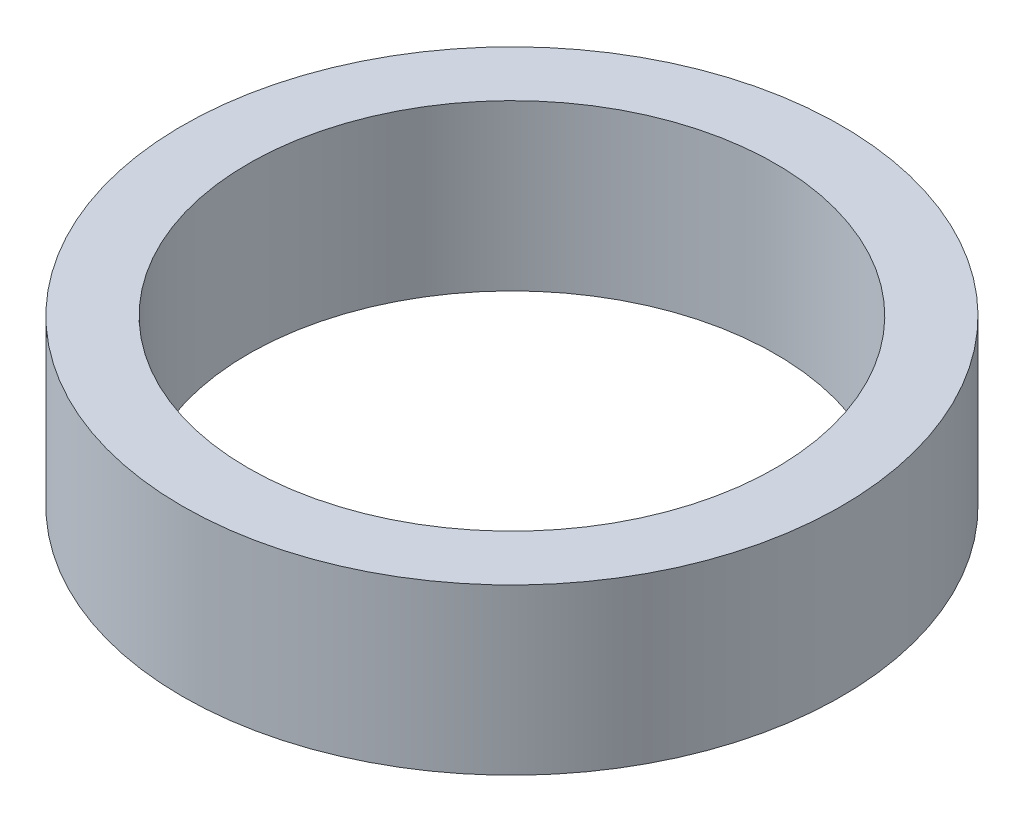
ISO-10303-21;
HEADER;
FILE_DESCRIPTION(('STEP AP214'),'2;1');
FILE_NAME('part.step','',(''),(''),'','','');
FILE_SCHEMA(('AUTOMOTIVE_DESIGN { 1 0 10303 214 1 1 1 1 }'));
ENDSEC;
DATA;
#1=APPLICATION_CONTEXT('core data for automotive mechanical design processes');
#2=APPLICATION_PROTOCOL_DEFINITION('international standard','automotive_design',2000,#1);
#3=PRODUCT_CONTEXT('',#1,'mechanical');
#4=PRODUCT('Part','Part','',(#3));
#5=PRODUCT_RELATED_PRODUCT_CATEGORY('part','',(#4));
#6=PRODUCT_DEFINITION_FORMATION('','',#4);
#7=PRODUCT_DEFINITION_CONTEXT('part definition',#1,'design');
#8=PRODUCT_DEFINITION('design','',#6,#7);
#9=PRODUCT_DEFINITION_SHAPE('','',#8);
#10=(LENGTH_UNIT() NAMED_UNIT(*) SI_UNIT(.MILLI.,.METRE.));
#11=(NAMED_UNIT(*) PLANE_ANGLE_UNIT() SI_UNIT($,.RADIAN.));
#12=(NAMED_UNIT(*) SI_UNIT($,.STERADIAN.) SOLID_ANGLE_UNIT());
#13=UNCERTAINTY_MEASURE_WITH_UNIT(LENGTH_MEASURE(1.E-05),#10,'distance_accuracy_value','');
#14=(GEOMETRIC_REPRESENTATION_CONTEXT(3) GLOBAL_UNCERTAINTY_ASSIGNED_CONTEXT((#13)) GLOBAL_UNIT_ASSIGNED_CONTEXT((#10,
#11,#12)) REPRESENTATION_CONTEXT('',''));
#15=CARTESIAN_POINT('',(0.,0.,0.));
#16=DIRECTION('',(0.,0.,1.));
#17=DIRECTION('',(1.,0.,0.));
#18=AXIS2_PLACEMENT_3D('',#15,#16,#17);
#19=CARTESIAN_POINT('',(0.,25.,0.));
#20=DIRECTION('',(0.,-1.,0.));
#21=DIRECTION('',(0.,0.,-1.));
#22=AXIS2_PLACEMENT_3D('',#19,#20,#21);
#23=CYLINDRICAL_SURFACE('',#22,50.);
#24=CARTESIAN_POINT('',(0.,25.,0.));
#25=DIRECTION('',(0.,1.,0.));
#26=DIRECTION('',(0.,0.,1.));
#27=AXIS2_PLACEMENT_3D('',#24,#25,#26);
#28=CIRCLE('',#27,50.);
#29=CARTESIAN_POINT('',(0.,25.,50.));
#30=VERTEX_POINT('',#29);
#31=EDGE_CURVE('E10',#30,#30,#28,.T.);
#32=ORIENTED_EDGE('',*,*,#31,.F.);
#33=EDGE_LOOP('',(#32));
#34=FACE_BOUND('',#33,.T.);
#35=CARTESIAN_POINT('',(0.,0.,0.));
#36=DIRECTION('',(0.,1.,0.));
#37=DIRECTION('',(0.,0.,1.));
#38=AXIS2_PLACEMENT_3D('',#35,#36,#37);
#39=CIRCLE('',#38,50.);
#40=CARTESIAN_POINT('',(0.,0.,50.));
#41=VERTEX_POINT('',#40);
#42=EDGE_CURVE('E37',#41,#41,#39,.T.);
#43=ORIENTED_EDGE('',*,*,#42,.T.);
#44=EDGE_LOOP('',(#43));
#45=FACE_BOUND('',#44,.T.);
#46=ADVANCED_FACE('F40',(#34,#45),#23,.T.);
#47=CARTESIAN_POINT('',(0.,25.,0.));
#48=DIRECTION('',(0.,1.,0.));
#49=DIRECTION('',(0.,0.,1.));
#50=AXIS2_PLACEMENT_3D('',#47,#48,#49);
#51=PLANE('',#50);
#52=CARTESIAN_POINT('',(0.,25.,0.));
#53=DIRECTION('',(0.,1.,0.));
#54=DIRECTION('',(0.,0.,1.));
#55=AXIS2_PLACEMENT_3D('',#52,#53,#54);
#56=CIRCLE('',#55,40.);
#57=CARTESIAN_POINT('',(0.,25.,40.));
#58=VERTEX_POINT('',#57);
#59=EDGE_CURVE('E50',#58,#58,#56,.T.);
#60=ORIENTED_EDGE('',*,*,#59,.F.);
#61=EDGE_LOOP('',(#60));
#62=FACE_BOUND('',#61,.T.);
#63=ORIENTED_EDGE('',*,*,#31,.T.);
#64=EDGE_LOOP('',(#63));
#65=FACE_BOUND('',#64,.T.);
#66=ADVANCED_FACE('F59',(#62,#65),#51,.T.);
#67=CARTESIAN_POINT('',(0.,0.,0.));
#68=DIRECTION('',(0.,1.,0.));
#69=DIRECTION('',(0.,0.,1.));
#70=AXIS2_PLACEMENT_3D('',#67,#68,#69);
#71=PLANE('',#70);
#72=CARTESIAN_POINT('',(0.,0.,0.));
#73=DIRECTION('',(0.,1.,0.));
#74=DIRECTION('',(0.,0.,1.));
#75=AXIS2_PLACEMENT_3D('',#72,#73,#74);
#76=CIRCLE('',#75,40.);
#77=CARTESIAN_POINT('',(0.,0.,40.));
#78=VERTEX_POINT('',#77);
#79=EDGE_CURVE('E47',#78,#78,#76,.T.);
#80=ORIENTED_EDGE('',*,*,#79,.T.);
#81=EDGE_LOOP('',(#80));
#82=FACE_BOUND('',#81,.T.);
#83=ORIENTED_EDGE('',*,*,#42,.F.);
#84=EDGE_LOOP('',(#83));
#85=FACE_BOUND('',#84,.T.);
#86=ADVANCED_FACE('F58',(#82,#85),#71,.F.);
#87=CARTESIAN_POINT('',(0.,25.,0.));
#88=DIRECTION('',(0.,-1.,0.));
#89=DIRECTION('',(0.,0.,-1.));
#90=AXIS2_PLACEMENT_3D('',#87,#88,#89);
#91=CYLINDRICAL_SURFACE('',#90,40.);
#92=ORIENTED_EDGE('',*,*,#59,.T.);
#93=EDGE_LOOP('',(#92));
#94=FACE_BOUND('',#93,.T.);
#95=ORIENTED_EDGE('',*,*,#79,.F.);
#96=EDGE_LOOP('',(#95));
#97=FACE_BOUND('',#96,.T.);
#98=ADVANCED_FACE('F54',(#94,#97),#91,.F.);
#99=CLOSED_SHELL('',(#46,#66,#86,#98));
#100=MANIFOLD_SOLID_BREP('B2',#99);
#101=ADVANCED_BREP_SHAPE_REPRESENTATION('',(#18,#100),#14);
#102=SHAPE_DEFINITION_REPRESENTATION(#9,#101);
ENDSEC;
END-ISO-10303-21;
